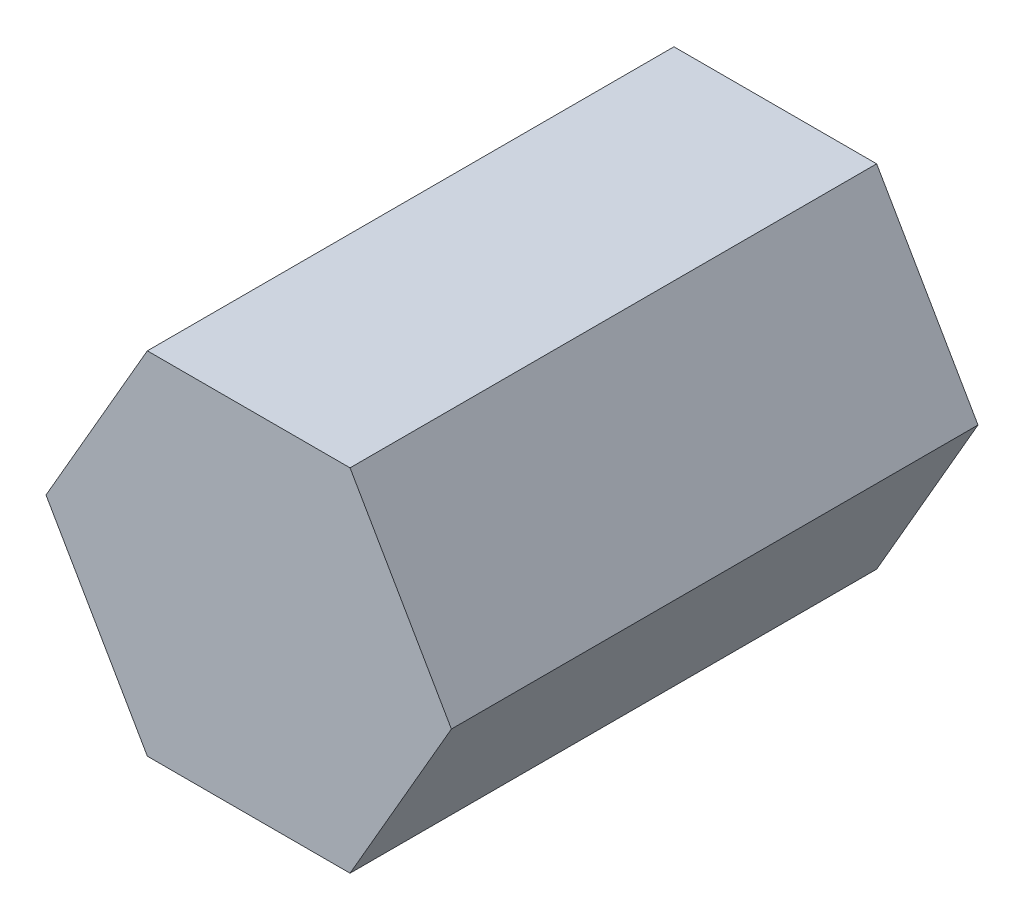
ISO-10303-21;
HEADER;
FILE_DESCRIPTION(('STEP AP214'),'2;1');
FILE_NAME('part.step','',(''),(''),'','','');
FILE_SCHEMA(('AUTOMOTIVE_DESIGN { 1 0 10303 214 1 1 1 1 }'));
ENDSEC;
DATA;
#1=APPLICATION_CONTEXT('core data for automotive mechanical design processes');
#2=APPLICATION_PROTOCOL_DEFINITION('international standard','automotive_design',2000,#1);
#3=PRODUCT_CONTEXT('',#1,'mechanical');
#4=PRODUCT('Part','Part','',(#3));
#5=PRODUCT_RELATED_PRODUCT_CATEGORY('part','',(#4));
#6=PRODUCT_DEFINITION_FORMATION('','',#4);
#7=PRODUCT_DEFINITION_CONTEXT('part definition',#1,'design');
#8=PRODUCT_DEFINITION('design','',#6,#7);
#9=PRODUCT_DEFINITION_SHAPE('','',#8);
#10=(LENGTH_UNIT() NAMED_UNIT(*) SI_UNIT(.MILLI.,.METRE.));
#11=(NAMED_UNIT(*) PLANE_ANGLE_UNIT() SI_UNIT($,.RADIAN.));
#12=(NAMED_UNIT(*) SI_UNIT($,.STERADIAN.) SOLID_ANGLE_UNIT());
#13=UNCERTAINTY_MEASURE_WITH_UNIT(LENGTH_MEASURE(1.E-05),#10,'distance_accuracy_value','');
#14=(GEOMETRIC_REPRESENTATION_CONTEXT(3) GLOBAL_UNCERTAINTY_ASSIGNED_CONTEXT((#13)) GLOBAL_UNIT_ASSIGNED_CONTEXT((#10,
#11,#12)) REPRESENTATION_CONTEXT('',''));
#15=CARTESIAN_POINT('',(0.,0.,0.));
#16=DIRECTION('',(0.,0.,1.));
#17=DIRECTION('',(1.,0.,0.));
#18=AXIS2_PLACEMENT_3D('',#15,#16,#17);
#19=CARTESIAN_POINT('',(28.8675134594813,0.,37.5));
#20=DIRECTION('',(-0.866025403784438,-0.5,0.));
#21=DIRECTION('',(0.5,-0.866025403784439,0.));
#22=AXIS2_PLACEMENT_3D('',#19,#20,#21);
#23=PLANE('',#22);
#24=DIRECTION('',(-0.5,0.866025403784438,0.));
#25=VECTOR('',#24,1.);
#26=CARTESIAN_POINT('',(28.8675134594813,0.,-37.5));
#27=LINE('',#26,#25);
#28=CARTESIAN_POINT('',(28.8675134594813,0.,-37.5));
#29=VERTEX_POINT('',#28);
#30=CARTESIAN_POINT('',(14.4337567297406,25.,-37.5));
#31=VERTEX_POINT('',#30);
#32=EDGE_CURVE('E121',#29,#31,#27,.T.);
#33=ORIENTED_EDGE('',*,*,#32,.T.);
#34=DIRECTION('',(0.,0.,-1.));
#35=VECTOR('',#34,1.);
#36=CARTESIAN_POINT('',(14.4337567297406,25.,37.5));
#37=LINE('',#36,#35);
#38=CARTESIAN_POINT('',(14.4337567297406,25.,37.5));
#39=VERTEX_POINT('',#38);
#40=EDGE_CURVE('E11',#39,#31,#37,.T.);
#41=ORIENTED_EDGE('',*,*,#40,.F.);
#42=DIRECTION('',(-0.5,0.866025403784438,0.));
#43=VECTOR('',#42,1.);
#44=CARTESIAN_POINT('',(28.8675134594813,0.,37.5));
#45=LINE('',#44,#43);
#46=CARTESIAN_POINT('',(28.8675134594813,0.,37.5));
#47=VERTEX_POINT('',#46);
#48=EDGE_CURVE('E131',#47,#39,#45,.T.);
#49=ORIENTED_EDGE('',*,*,#48,.F.);
#50=DIRECTION('',(0.,0.,-1.));
#51=VECTOR('',#50,1.);
#52=CARTESIAN_POINT('',(28.8675134594813,0.,37.5));
#53=LINE('',#52,#51);
#54=EDGE_CURVE('E117',#47,#29,#53,.T.);
#55=ORIENTED_EDGE('',*,*,#54,.T.);
#56=EDGE_LOOP('',(#33,#41,#49,#55));
#57=FACE_BOUND('',#56,.T.);
#58=ADVANCED_FACE('F37',(#57),#23,.F.);
#59=CARTESIAN_POINT('',(14.4337567297406,25.,37.5));
#60=DIRECTION('',(0.,-1.,0.));
#61=DIRECTION('',(1.,0.,0.));
#62=AXIS2_PLACEMENT_3D('',#59,#60,#61);
#63=PLANE('',#62);
#64=DIRECTION('',(-1.,0.,0.));
#65=VECTOR('',#64,1.);
#66=CARTESIAN_POINT('',(14.4337567297406,25.,-37.5));
#67=LINE('',#66,#65);
#68=CARTESIAN_POINT('',(-14.4337567297407,25.,-37.5));
#69=VERTEX_POINT('',#68);
#70=EDGE_CURVE('E124',#31,#69,#67,.T.);
#71=ORIENTED_EDGE('',*,*,#70,.T.);
#72=DIRECTION('',(0.,0.,-1.));
#73=VECTOR('',#72,1.);
#74=CARTESIAN_POINT('',(-14.4337567297407,25.,37.5));
#75=LINE('',#74,#73);
#76=CARTESIAN_POINT('',(-14.4337567297407,25.,37.5));
#77=VERTEX_POINT('',#76);
#78=EDGE_CURVE('E45',#77,#69,#75,.T.);
#79=ORIENTED_EDGE('',*,*,#78,.F.);
#80=DIRECTION('',(-1.,0.,0.));
#81=VECTOR('',#80,1.);
#82=CARTESIAN_POINT('',(14.4337567297406,25.,37.5));
#83=LINE('',#82,#81);
#84=EDGE_CURVE('E90',#39,#77,#83,.T.);
#85=ORIENTED_EDGE('',*,*,#84,.F.);
#86=ORIENTED_EDGE('',*,*,#40,.T.);
#87=EDGE_LOOP('',(#71,#79,#85,#86));
#88=FACE_BOUND('',#87,.T.);
#89=ADVANCED_FACE('F155',(#88),#63,.F.);
#90=CARTESIAN_POINT('',(-14.4337567297407,25.,37.5));
#91=DIRECTION('',(0.866025403784439,-0.499999999999999,0.));
#92=DIRECTION('',(0.5,0.866025403784439,0.));
#93=AXIS2_PLACEMENT_3D('',#90,#91,#92);
#94=PLANE('',#93);
#95=DIRECTION('',(-0.499999999999999,-0.866025403784439,0.));
#96=VECTOR('',#95,1.);
#97=CARTESIAN_POINT('',(-14.4337567297407,25.,-37.5));
#98=LINE('',#97,#96);
#99=CARTESIAN_POINT('',(-28.8675134594813,0.,-37.5));
#100=VERTEX_POINT('',#99);
#101=EDGE_CURVE('E126',#69,#100,#98,.T.);
#102=ORIENTED_EDGE('',*,*,#101,.T.);
#103=DIRECTION('',(0.,0.,-1.));
#104=VECTOR('',#103,1.);
#105=CARTESIAN_POINT('',(-28.8675134594813,0.,37.5));
#106=LINE('',#105,#104);
#107=CARTESIAN_POINT('',(-28.8675134594813,0.,37.5));
#108=VERTEX_POINT('',#107);
#109=EDGE_CURVE('E112',#108,#100,#106,.T.);
#110=ORIENTED_EDGE('',*,*,#109,.F.);
#111=DIRECTION('',(-0.499999999999999,-0.866025403784439,0.));
#112=VECTOR('',#111,1.);
#113=CARTESIAN_POINT('',(-14.4337567297407,25.,37.5));
#114=LINE('',#113,#112);
#115=EDGE_CURVE('E103',#77,#108,#114,.T.);
#116=ORIENTED_EDGE('',*,*,#115,.F.);
#117=ORIENTED_EDGE('',*,*,#78,.T.);
#118=EDGE_LOOP('',(#102,#110,#116,#117));
#119=FACE_BOUND('',#118,.T.);
#120=ADVANCED_FACE('F137',(#119),#94,.F.);
#121=CARTESIAN_POINT('',(-28.8675134594813,0.,37.5));
#122=DIRECTION('',(0.866025403784438,0.5,0.));
#123=DIRECTION('',(-0.5,0.866025403784439,0.));
#124=AXIS2_PLACEMENT_3D('',#121,#122,#123);
#125=PLANE('',#124);
#126=DIRECTION('',(0.5,-0.866025403784438,0.));
#127=VECTOR('',#126,1.);
#128=CARTESIAN_POINT('',(-28.8675134594813,0.,-37.5));
#129=LINE('',#128,#127);
#130=CARTESIAN_POINT('',(-14.4337567297407,-25.,-37.5));
#131=VERTEX_POINT('',#130);
#132=EDGE_CURVE('E111',#100,#131,#129,.T.);
#133=ORIENTED_EDGE('',*,*,#132,.T.);
#134=DIRECTION('',(0.,0.,-1.));
#135=VECTOR('',#134,1.);
#136=CARTESIAN_POINT('',(-14.4337567297407,-25.,37.5));
#137=LINE('',#136,#135);
#138=CARTESIAN_POINT('',(-14.4337567297407,-25.,37.5));
#139=VERTEX_POINT('',#138);
#140=EDGE_CURVE('E108',#139,#131,#137,.T.);
#141=ORIENTED_EDGE('',*,*,#140,.F.);
#142=DIRECTION('',(0.5,-0.866025403784438,0.));
#143=VECTOR('',#142,1.);
#144=CARTESIAN_POINT('',(-28.8675134594813,0.,37.5));
#145=LINE('',#144,#143);
#146=EDGE_CURVE('E97',#108,#139,#145,.T.);
#147=ORIENTED_EDGE('',*,*,#146,.F.);
#148=ORIENTED_EDGE('',*,*,#109,.T.);
#149=EDGE_LOOP('',(#133,#141,#147,#148));
#150=FACE_BOUND('',#149,.T.);
#151=ADVANCED_FACE('F109',(#150),#125,.F.);
#152=CARTESIAN_POINT('',(-14.4337567297407,-25.,37.5));
#153=DIRECTION('',(0.,1.,0.));
#154=DIRECTION('',(-1.,0.,0.));
#155=AXIS2_PLACEMENT_3D('',#152,#153,#154);
#156=PLANE('',#155);
#157=DIRECTION('',(1.,0.,0.));
#158=VECTOR('',#157,1.);
#159=CARTESIAN_POINT('',(-14.4337567297407,-25.,-37.5));
#160=LINE('',#159,#158);
#161=CARTESIAN_POINT('',(14.4337567297406,-25.,-37.5));
#162=VERTEX_POINT('',#161);
#163=EDGE_CURVE('E76',#131,#162,#160,.T.);
#164=ORIENTED_EDGE('',*,*,#163,.T.);
#165=DIRECTION('',(0.,0.,-1.));
#166=VECTOR('',#165,1.);
#167=CARTESIAN_POINT('',(14.4337567297406,-25.,37.5));
#168=LINE('',#167,#166);
#169=CARTESIAN_POINT('',(14.4337567297406,-25.,37.5));
#170=VERTEX_POINT('',#169);
#171=EDGE_CURVE('E113',#170,#162,#168,.T.);
#172=ORIENTED_EDGE('',*,*,#171,.F.);
#173=DIRECTION('',(1.,0.,0.));
#174=VECTOR('',#173,1.);
#175=CARTESIAN_POINT('',(-14.4337567297407,-25.,37.5));
#176=LINE('',#175,#174);
#177=EDGE_CURVE('E101',#139,#170,#176,.T.);
#178=ORIENTED_EDGE('',*,*,#177,.F.);
#179=ORIENTED_EDGE('',*,*,#140,.T.);
#180=EDGE_LOOP('',(#164,#172,#178,#179));
#181=FACE_BOUND('',#180,.T.);
#182=ADVANCED_FACE('F115',(#181),#156,.F.);
#183=CARTESIAN_POINT('',(14.4337567297406,-25.,37.5));
#184=DIRECTION('',(-0.866025403784439,0.5,0.));
#185=DIRECTION('',(-0.5,-0.866025403784439,0.));
#186=AXIS2_PLACEMENT_3D('',#183,#184,#185);
#187=PLANE('',#186);
#188=DIRECTION('',(0.5,0.866025403784439,0.));
#189=VECTOR('',#188,1.);
#190=CARTESIAN_POINT('',(14.4337567297406,-25.,-37.5));
#191=LINE('',#190,#189);
#192=EDGE_CURVE('E82',#162,#29,#191,.T.);
#193=ORIENTED_EDGE('',*,*,#192,.T.);
#194=ORIENTED_EDGE('',*,*,#54,.F.);
#195=DIRECTION('',(0.5,0.866025403784439,0.));
#196=VECTOR('',#195,1.);
#197=CARTESIAN_POINT('',(14.4337567297406,-25.,37.5));
#198=LINE('',#197,#196);
#199=EDGE_CURVE('E53',#170,#47,#198,.T.);
#200=ORIENTED_EDGE('',*,*,#199,.F.);
#201=ORIENTED_EDGE('',*,*,#171,.T.);
#202=EDGE_LOOP('',(#193,#194,#200,#201));
#203=FACE_BOUND('',#202,.T.);
#204=ADVANCED_FACE('F144',(#203),#187,.F.);
#205=CARTESIAN_POINT('',(0.,0.,37.5));
#206=DIRECTION('',(0.,0.,1.));
#207=DIRECTION('',(1.,0.,0.));
#208=AXIS2_PLACEMENT_3D('',#205,#206,#207);
#209=PLANE('',#208);
#210=ORIENTED_EDGE('',*,*,#48,.T.);
#211=ORIENTED_EDGE('',*,*,#84,.T.);
#212=ORIENTED_EDGE('',*,*,#115,.T.);
#213=ORIENTED_EDGE('',*,*,#146,.T.);
#214=ORIENTED_EDGE('',*,*,#177,.T.);
#215=ORIENTED_EDGE('',*,*,#199,.T.);
#216=EDGE_LOOP('',(#210,#211,#212,#213,#214,#215));
#217=FACE_BOUND('',#216,.T.);
#218=ADVANCED_FACE('F99',(#217),#209,.T.);
#219=CARTESIAN_POINT('',(0.,0.,-37.5));
#220=DIRECTION('',(0.,0.,1.));
#221=DIRECTION('',(1.,0.,0.));
#222=AXIS2_PLACEMENT_3D('',#219,#220,#221);
#223=PLANE('',#222);
#224=ORIENTED_EDGE('',*,*,#32,.F.);
#225=ORIENTED_EDGE('',*,*,#192,.F.);
#226=ORIENTED_EDGE('',*,*,#163,.F.);
#227=ORIENTED_EDGE('',*,*,#132,.F.);
#228=ORIENTED_EDGE('',*,*,#101,.F.);
#229=ORIENTED_EDGE('',*,*,#70,.F.);
#230=EDGE_LOOP('',(#224,#225,#226,#227,#228,#229));
#231=FACE_BOUND('',#230,.T.);
#232=ADVANCED_FACE('F140',(#231),#223,.F.);
#233=CLOSED_SHELL('',(#58,#89,#120,#151,#182,#204,#218,#232));
#234=MANIFOLD_SOLID_BREP('B2',#233);
#235=ADVANCED_BREP_SHAPE_REPRESENTATION('',(#18,#234),#14);
#236=SHAPE_DEFINITION_REPRESENTATION(#9,#235);
ENDSEC;
END-ISO-10303-21;
